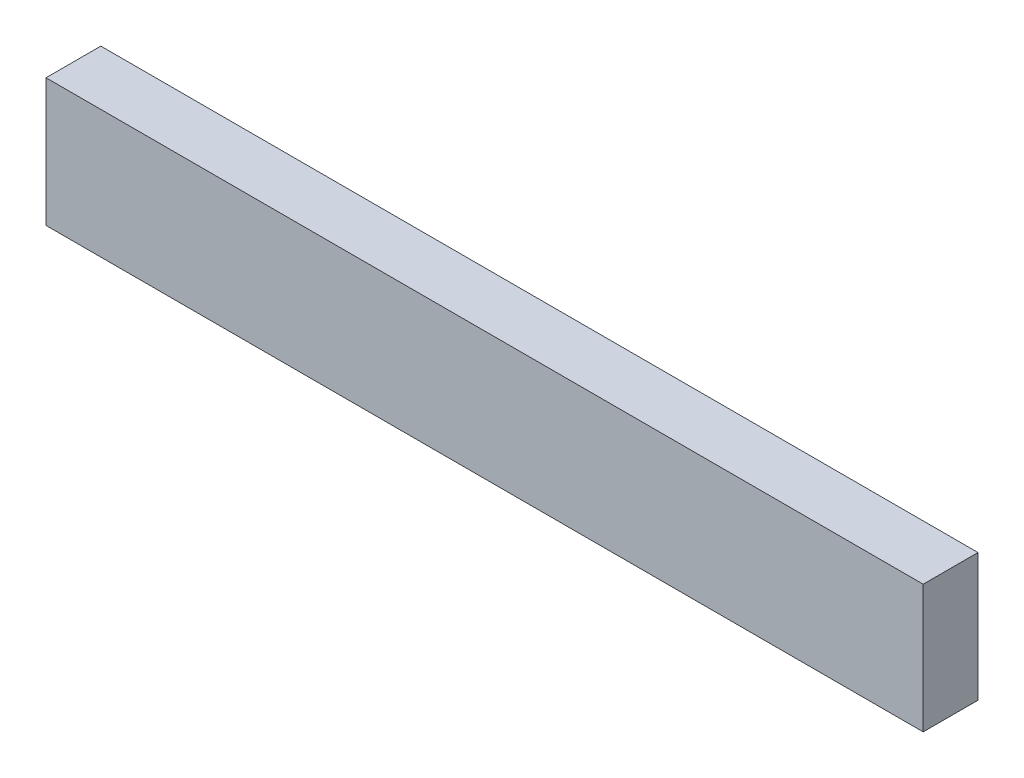
ISO-10303-21;
HEADER;
FILE_DESCRIPTION(('STEP AP214'),'2;1');
FILE_NAME('part.step','',(''),(''),'','','');
FILE_SCHEMA(('AUTOMOTIVE_DESIGN { 1 0 10303 214 1 1 1 1 }'));
ENDSEC;
DATA;
#1=APPLICATION_CONTEXT('core data for automotive mechanical design processes');
#2=APPLICATION_PROTOCOL_DEFINITION('international standard','automotive_design',2000,#1);
#3=PRODUCT_CONTEXT('',#1,'mechanical');
#4=PRODUCT('Part','Part','',(#3));
#5=PRODUCT_RELATED_PRODUCT_CATEGORY('part','',(#4));
#6=PRODUCT_DEFINITION_FORMATION('','',#4);
#7=PRODUCT_DEFINITION_CONTEXT('part definition',#1,'design');
#8=PRODUCT_DEFINITION('design','',#6,#7);
#9=PRODUCT_DEFINITION_SHAPE('','',#8);
#10=(LENGTH_UNIT() NAMED_UNIT(*) SI_UNIT(.MILLI.,.METRE.));
#11=(NAMED_UNIT(*) PLANE_ANGLE_UNIT() SI_UNIT($,.RADIAN.));
#12=(NAMED_UNIT(*) SI_UNIT($,.STERADIAN.) SOLID_ANGLE_UNIT());
#13=UNCERTAINTY_MEASURE_WITH_UNIT(LENGTH_MEASURE(1.E-05),#10,'distance_accuracy_value','');
#14=(GEOMETRIC_REPRESENTATION_CONTEXT(3) GLOBAL_UNCERTAINTY_ASSIGNED_CONTEXT((#13)) GLOBAL_UNIT_ASSIGNED_CONTEXT((#10,
#11,#12)) REPRESENTATION_CONTEXT('',''));
#15=CARTESIAN_POINT('',(0.,0.,0.));
#16=DIRECTION('',(0.,0.,1.));
#17=DIRECTION('',(1.,0.,0.));
#18=AXIS2_PLACEMENT_3D('',#15,#16,#17);
#19=CARTESIAN_POINT('',(-304.8,-44.45,-19.05));
#20=DIRECTION('',(0.,0.,-1.));
#21=DIRECTION('',(-1.,0.,0.));
#22=AXIS2_PLACEMENT_3D('',#19,#20,#21);
#23=PLANE('',#22);
#24=DIRECTION('',(1.,0.,0.));
#25=VECTOR('',#24,1.);
#26=CARTESIAN_POINT('',(-304.8,44.45,-19.05));
#27=LINE('',#26,#25);
#28=CARTESIAN_POINT('',(-304.8,44.45,-19.05));
#29=VERTEX_POINT('',#28);
#30=CARTESIAN_POINT('',(304.8,44.45,-19.05));
#31=VERTEX_POINT('',#30);
#32=EDGE_CURVE('E35',#29,#31,#27,.T.);
#33=ORIENTED_EDGE('',*,*,#32,.T.);
#34=DIRECTION('',(0.,1.,0.));
#35=VECTOR('',#34,1.);
#36=CARTESIAN_POINT('',(304.8,-44.45,-19.05));
#37=LINE('',#36,#35);
#38=CARTESIAN_POINT('',(304.8,-44.45,-19.05));
#39=VERTEX_POINT('',#38);
#40=EDGE_CURVE('E72',#39,#31,#37,.T.);
#41=ORIENTED_EDGE('',*,*,#40,.F.);
#42=DIRECTION('',(1.,0.,0.));
#43=VECTOR('',#42,1.);
#44=CARTESIAN_POINT('',(-304.8,-44.45,-19.05));
#45=LINE('',#44,#43);
#46=CARTESIAN_POINT('',(-304.8,-44.45,-19.05));
#47=VERTEX_POINT('',#46);
#48=EDGE_CURVE('E11',#47,#39,#45,.T.);
#49=ORIENTED_EDGE('',*,*,#48,.F.);
#50=DIRECTION('',(0.,1.,0.));
#51=VECTOR('',#50,1.);
#52=CARTESIAN_POINT('',(-304.8,-44.45,-19.05));
#53=LINE('',#52,#51);
#54=EDGE_CURVE('E73',#47,#29,#53,.T.);
#55=ORIENTED_EDGE('',*,*,#54,.T.);
#56=EDGE_LOOP('',(#33,#41,#49,#55));
#57=FACE_BOUND('',#56,.T.);
#58=ADVANCED_FACE('F32',(#57),#23,.T.);
#59=CARTESIAN_POINT('',(-304.8,-44.45,19.05));
#60=DIRECTION('',(0.,-1.,0.));
#61=DIRECTION('',(0.,0.,-1.));
#62=AXIS2_PLACEMENT_3D('',#59,#60,#61);
#63=PLANE('',#62);
#64=ORIENTED_EDGE('',*,*,#48,.T.);
#65=DIRECTION('',(0.,0.,-1.));
#66=VECTOR('',#65,1.);
#67=CARTESIAN_POINT('',(304.8,-44.45,19.05));
#68=LINE('',#67,#66);
#69=CARTESIAN_POINT('',(304.8,-44.45,19.05));
#70=VERTEX_POINT('',#69);
#71=EDGE_CURVE('E89',#70,#39,#68,.T.);
#72=ORIENTED_EDGE('',*,*,#71,.F.);
#73=DIRECTION('',(1.,0.,0.));
#74=VECTOR('',#73,1.);
#75=CARTESIAN_POINT('',(-304.8,-44.45,19.05));
#76=LINE('',#75,#74);
#77=CARTESIAN_POINT('',(-304.8,-44.45,19.05));
#78=VERTEX_POINT('',#77);
#79=EDGE_CURVE('E40',#78,#70,#76,.T.);
#80=ORIENTED_EDGE('',*,*,#79,.F.);
#81=DIRECTION('',(0.,0.,-1.));
#82=VECTOR('',#81,1.);
#83=CARTESIAN_POINT('',(-304.8,-44.45,19.05));
#84=LINE('',#83,#82);
#85=EDGE_CURVE('E78',#78,#47,#84,.T.);
#86=ORIENTED_EDGE('',*,*,#85,.T.);
#87=EDGE_LOOP('',(#64,#72,#80,#86));
#88=FACE_BOUND('',#87,.T.);
#89=ADVANCED_FACE('F104',(#88),#63,.T.);
#90=CARTESIAN_POINT('',(-304.8,-44.45,19.05));
#91=DIRECTION('',(0.,0.,1.));
#92=DIRECTION('',(1.,0.,0.));
#93=AXIS2_PLACEMENT_3D('',#90,#91,#92);
#94=PLANE('',#93);
#95=ORIENTED_EDGE('',*,*,#79,.T.);
#96=DIRECTION('',(0.,-1.,0.));
#97=VECTOR('',#96,1.);
#98=CARTESIAN_POINT('',(304.8,-44.45,19.05));
#99=LINE('',#98,#97);
#100=CARTESIAN_POINT('',(304.8,44.45,19.05));
#101=VERTEX_POINT('',#100);
#102=EDGE_CURVE('E85',#101,#70,#99,.T.);
#103=ORIENTED_EDGE('',*,*,#102,.F.);
#104=DIRECTION('',(1.,0.,0.));
#105=VECTOR('',#104,1.);
#106=CARTESIAN_POINT('',(-304.8,44.45,19.05));
#107=LINE('',#106,#105);
#108=CARTESIAN_POINT('',(-304.8,44.45,19.05));
#109=VERTEX_POINT('',#108);
#110=EDGE_CURVE('E77',#109,#101,#107,.T.);
#111=ORIENTED_EDGE('',*,*,#110,.F.);
#112=DIRECTION('',(0.,-1.,0.));
#113=VECTOR('',#112,1.);
#114=CARTESIAN_POINT('',(-304.8,-44.45,19.05));
#115=LINE('',#114,#113);
#116=EDGE_CURVE('E97',#109,#78,#115,.T.);
#117=ORIENTED_EDGE('',*,*,#116,.T.);
#118=EDGE_LOOP('',(#95,#103,#111,#117));
#119=FACE_BOUND('',#118,.T.);
#120=ADVANCED_FACE('F101',(#119),#94,.T.);
#121=CARTESIAN_POINT('',(-304.8,44.45,19.05));
#122=DIRECTION('',(0.,1.,0.));
#123=DIRECTION('',(0.,0.,1.));
#124=AXIS2_PLACEMENT_3D('',#121,#122,#123);
#125=PLANE('',#124);
#126=ORIENTED_EDGE('',*,*,#110,.T.);
#127=DIRECTION('',(0.,0.,1.));
#128=VECTOR('',#127,1.);
#129=CARTESIAN_POINT('',(304.8,44.45,19.05));
#130=LINE('',#129,#128);
#131=EDGE_CURVE('E80',#31,#101,#130,.T.);
#132=ORIENTED_EDGE('',*,*,#131,.F.);
#133=ORIENTED_EDGE('',*,*,#32,.F.);
#134=DIRECTION('',(0.,0.,1.));
#135=VECTOR('',#134,1.);
#136=CARTESIAN_POINT('',(-304.8,44.45,19.05));
#137=LINE('',#136,#135);
#138=EDGE_CURVE('E95',#29,#109,#137,.T.);
#139=ORIENTED_EDGE('',*,*,#138,.T.);
#140=EDGE_LOOP('',(#126,#132,#133,#139));
#141=FACE_BOUND('',#140,.T.);
#142=ADVANCED_FACE('F81',(#141),#125,.T.);
#143=CARTESIAN_POINT('',(-304.8,0.,0.));
#144=DIRECTION('',(-1.,0.,0.));
#145=DIRECTION('',(0.,0.,1.));
#146=AXIS2_PLACEMENT_3D('',#143,#144,#145);
#147=PLANE('',#146);
#148=ORIENTED_EDGE('',*,*,#54,.F.);
#149=ORIENTED_EDGE('',*,*,#85,.F.);
#150=ORIENTED_EDGE('',*,*,#116,.F.);
#151=ORIENTED_EDGE('',*,*,#138,.F.);
#152=EDGE_LOOP('',(#148,#149,#150,#151));
#153=FACE_BOUND('',#152,.T.);
#154=ADVANCED_FACE('F106',(#153),#147,.T.);
#155=CARTESIAN_POINT('',(304.8,0.,0.));
#156=DIRECTION('',(-1.,0.,0.));
#157=DIRECTION('',(0.,0.,1.));
#158=AXIS2_PLACEMENT_3D('',#155,#156,#157);
#159=PLANE('',#158);
#160=ORIENTED_EDGE('',*,*,#40,.T.);
#161=ORIENTED_EDGE('',*,*,#131,.T.);
#162=ORIENTED_EDGE('',*,*,#102,.T.);
#163=ORIENTED_EDGE('',*,*,#71,.T.);
#164=EDGE_LOOP('',(#160,#161,#162,#163));
#165=FACE_BOUND('',#164,.T.);
#166=ADVANCED_FACE('F88',(#165),#159,.F.);
#167=CLOSED_SHELL('',(#58,#89,#120,#142,#154,#166));
#168=MANIFOLD_SOLID_BREP('B2',#167);
#169=ADVANCED_BREP_SHAPE_REPRESENTATION('',(#18,#168),#14);
#170=SHAPE_DEFINITION_REPRESENTATION(#9,#169);
ENDSEC;
END-ISO-10303-21;
